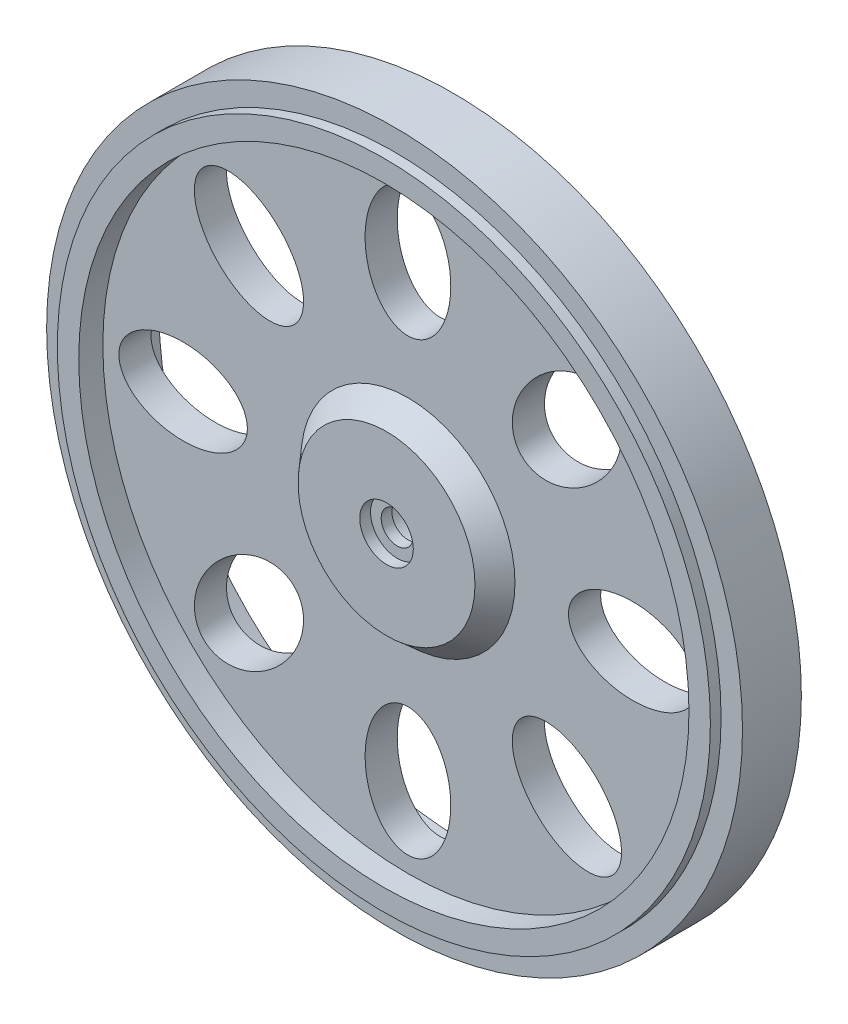
ISO-10303-21;
HEADER;
FILE_DESCRIPTION(('STEP AP214'),'2;1');
FILE_NAME('part.step','',(''),(''),'','','');
FILE_SCHEMA(('AUTOMOTIVE_DESIGN { 1 0 10303 214 1 1 1 1 }'));
ENDSEC;
DATA;
#1=APPLICATION_CONTEXT('core data for automotive mechanical design processes');
#2=APPLICATION_PROTOCOL_DEFINITION('international standard','automotive_design',2000,#1);
#3=PRODUCT_CONTEXT('',#1,'mechanical');
#4=PRODUCT('Part','Part','',(#3));
#5=PRODUCT_RELATED_PRODUCT_CATEGORY('part','',(#4));
#6=PRODUCT_DEFINITION_FORMATION('','',#4);
#7=PRODUCT_DEFINITION_CONTEXT('part definition',#1,'design');
#8=PRODUCT_DEFINITION('design','',#6,#7);
#9=PRODUCT_DEFINITION_SHAPE('','',#8);
#10=(LENGTH_UNIT() NAMED_UNIT(*) SI_UNIT(.MILLI.,.METRE.));
#11=(NAMED_UNIT(*) PLANE_ANGLE_UNIT() SI_UNIT($,.RADIAN.));
#12=(NAMED_UNIT(*) SI_UNIT($,.STERADIAN.) SOLID_ANGLE_UNIT());
#13=UNCERTAINTY_MEASURE_WITH_UNIT(LENGTH_MEASURE(1.E-05),#10,'distance_accuracy_value','');
#14=(GEOMETRIC_REPRESENTATION_CONTEXT(3) GLOBAL_UNCERTAINTY_ASSIGNED_CONTEXT((#13)) GLOBAL_UNIT_ASSIGNED_CONTEXT((#10,
#11,#12)) REPRESENTATION_CONTEXT('',''));
#15=CARTESIAN_POINT('',(0.,0.,0.));
#16=DIRECTION('',(0.,0.,1.));
#17=DIRECTION('',(1.,0.,0.));
#18=AXIS2_PLACEMENT_3D('',#15,#16,#17);
#19=CARTESIAN_POINT('',(0.,0.,26.5));
#20=DIRECTION('',(0.,0.,-1.));
#21=DIRECTION('',(-1.,0.,0.));
#22=AXIS2_PLACEMENT_3D('',#19,#20,#21);
#23=CYLINDRICAL_SURFACE('',#22,1.5);
#24=CARTESIAN_POINT('',(0.,0.,2.5));
#25=DIRECTION('',(0.,0.,1.));
#26=DIRECTION('',(1.,0.,0.));
#27=AXIS2_PLACEMENT_3D('',#24,#25,#26);
#28=CIRCLE('',#27,1.5);
#29=CARTESIAN_POINT('',(1.5,0.,2.5));
#30=VERTEX_POINT('',#29);
#31=EDGE_CURVE('E50',#30,#30,#28,.F.);
#32=ORIENTED_EDGE('',*,*,#31,.F.);
#33=EDGE_LOOP('',(#32));
#34=FACE_BOUND('',#33,.T.);
#35=CARTESIAN_POINT('',(0.,0.,1.5));
#36=DIRECTION('',(0.,0.,-1.));
#37=DIRECTION('',(-1.,0.,0.));
#38=AXIS2_PLACEMENT_3D('',#35,#36,#37);
#39=CIRCLE('',#38,1.5);
#40=CARTESIAN_POINT('',(-1.5,0.,1.5));
#41=VERTEX_POINT('',#40);
#42=EDGE_CURVE('E38',#41,#41,#39,.T.);
#43=ORIENTED_EDGE('',*,*,#42,.T.);
#44=EDGE_LOOP('',(#43));
#45=FACE_BOUND('',#44,.T.);
#46=ADVANCED_FACE('F34',(#34,#45),#23,.F.);
#47=CARTESIAN_POINT('',(0.,0.,-5.5));
#48=DIRECTION('',(0.,0.,-1.));
#49=DIRECTION('',(-1.,0.,0.));
#50=AXIS2_PLACEMENT_3D('',#47,#48,#49);
#51=PLANE('',#50);
#52=CARTESIAN_POINT('',(0.,0.,-5.5));
#53=DIRECTION('',(0.,0.,-1.));
#54=DIRECTION('',(-1.,0.,0.));
#55=AXIS2_PLACEMENT_3D('',#52,#53,#54);
#56=CIRCLE('',#55,2.75);
#57=CARTESIAN_POINT('',(-2.75,0.,-5.5));
#58=VERTEX_POINT('',#57);
#59=EDGE_CURVE('E412',#58,#58,#56,.T.);
#60=ORIENTED_EDGE('',*,*,#59,.F.);
#61=EDGE_LOOP('',(#60));
#62=FACE_BOUND('',#61,.T.);
#63=CARTESIAN_POINT('',(0.,0.,-5.5));
#64=DIRECTION('',(0.,0.,-1.));
#65=DIRECTION('',(-1.,0.,0.));
#66=AXIS2_PLACEMENT_3D('',#63,#64,#65);
#67=CIRCLE('',#66,4.42820323027551);
#68=CARTESIAN_POINT('',(-4.42820323027551,0.,-5.5));
#69=VERTEX_POINT('',#68);
#70=EDGE_CURVE('E70',#69,#69,#67,.T.);
#71=ORIENTED_EDGE('',*,*,#70,.T.);
#72=EDGE_LOOP('',(#71));
#73=FACE_BOUND('',#72,.T.);
#74=ADVANCED_FACE('F138',(#62,#73),#51,.T.);
#75=CARTESIAN_POINT('',(0.,0.,2.5));
#76=DIRECTION('',(0.,0.,1.));
#77=DIRECTION('',(1.,0.,0.));
#78=AXIS2_PLACEMENT_3D('',#75,#76,#77);
#79=PLANE('',#78);
#80=CARTESIAN_POINT('',(0.,0.,2.5));
#81=DIRECTION('',(0.,0.,1.));
#82=DIRECTION('',(1.,0.,0.));
#83=AXIS2_PLACEMENT_3D('',#80,#81,#82);
#84=CIRCLE('',#83,2.5);
#85=CARTESIAN_POINT('',(2.5,0.,2.5));
#86=VERTEX_POINT('',#85);
#87=EDGE_CURVE('E57',#86,#86,#84,.T.);
#88=ORIENTED_EDGE('',*,*,#87,.T.);
#89=EDGE_LOOP('',(#88));
#90=FACE_BOUND('',#89,.T.);
#91=ORIENTED_EDGE('',*,*,#31,.T.);
#92=EDGE_LOOP('',(#91));
#93=FACE_BOUND('',#92,.T.);
#94=ADVANCED_FACE('F129',(#90,#93),#79,.T.);
#95=CARTESIAN_POINT('',(0.,28.5,-1.5));
#96=DIRECTION('',(0.,0.,1.));
#97=DIRECTION('',(1.,0.,0.));
#98=AXIS2_PLACEMENT_3D('',#95,#96,#97);
#99=PLANE('',#98);
#100=CARTESIAN_POINT('',(14.8492424049173,14.8492424049177,-1.5));
#101=DIRECTION('',(0.,0.,1.));
#102=DIRECTION('',(-0.707106781186539,-0.707106781186556,0.));
#103=AXIS2_PLACEMENT_3D('',#100,#101,#102);
#104=ELLIPSE('',#103,6.,4.);
#105=CARTESIAN_POINT('',(10.6066017177981,10.6066017177983,-1.5));
#106=VERTEX_POINT('',#105);
#107=EDGE_CURVE('E417',#106,#106,#104,.T.);
#108=ORIENTED_EDGE('',*,*,#107,.T.);
#109=EDGE_LOOP('',(#108));
#110=FACE_BOUND('',#109,.T.);
#111=CARTESIAN_POINT('',(21.,2.19963451749891E-13,-1.5));
#112=DIRECTION('',(0.,0.,1.));
#113=DIRECTION('',(-1.,0.,0.));
#114=AXIS2_PLACEMENT_3D('',#111,#112,#113);
#115=ELLIPSE('',#114,6.,4.);
#116=CARTESIAN_POINT('',(15.,1.57116751249922E-13,-1.5));
#117=VERTEX_POINT('',#116);
#118=EDGE_CURVE('E423',#117,#117,#115,.T.);
#119=ORIENTED_EDGE('',*,*,#118,.T.);
#120=EDGE_LOOP('',(#119));
#121=FACE_BOUND('',#120,.T.);
#122=CARTESIAN_POINT('',(14.8492424049176,-14.8492424049174,-1.5));
#123=DIRECTION('',(0.,0.,1.));
#124=DIRECTION('',(-0.707106781186554,0.707106781186541,0.));
#125=AXIS2_PLACEMENT_3D('',#122,#123,#124);
#126=ELLIPSE('',#125,6.,4.);
#127=CARTESIAN_POINT('',(10.6066017177983,-10.6066017177981,-1.5));
#128=VERTEX_POINT('',#127);
#129=EDGE_CURVE('E434',#128,#128,#126,.T.);
#130=ORIENTED_EDGE('',*,*,#129,.T.);
#131=EDGE_LOOP('',(#130));
#132=FACE_BOUND('',#131,.T.);
#133=CARTESIAN_POINT('',(1.46642301166594E-13,-21.,-1.5));
#134=DIRECTION('',(0.,0.,1.));
#135=DIRECTION('',(0.,1.,0.));
#136=AXIS2_PLACEMENT_3D('',#133,#134,#135);
#137=ELLIPSE('',#136,6.,4.);
#138=CARTESIAN_POINT('',(1.04744500833281E-13,-15.,-1.5));
#139=VERTEX_POINT('',#138);
#140=EDGE_CURVE('E438',#139,#139,#137,.T.);
#141=ORIENTED_EDGE('',*,*,#140,.T.);
#142=EDGE_LOOP('',(#141));
#143=FACE_BOUND('',#142,.T.);
#144=CARTESIAN_POINT('',(-14.8492424049174,-14.8492424049176,-1.5));
#145=DIRECTION('',(0.,0.,1.));
#146=DIRECTION('',(0.707106781186544,0.707106781186551,0.));
#147=AXIS2_PLACEMENT_3D('',#144,#145,#146);
#148=ELLIPSE('',#147,6.,4.);
#149=CARTESIAN_POINT('',(-10.6066017177982,-10.6066017177983,-1.5));
#150=VERTEX_POINT('',#149);
#151=EDGE_CURVE('E445',#150,#150,#148,.T.);
#152=ORIENTED_EDGE('',*,*,#151,.T.);
#153=EDGE_LOOP('',(#152));
#154=FACE_BOUND('',#153,.T.);
#155=CARTESIAN_POINT('',(-21.,0.,-1.5));
#156=DIRECTION('',(0.,0.,1.));
#157=DIRECTION('',(1.,0.,0.));
#158=AXIS2_PLACEMENT_3D('',#155,#156,#157);
#159=ELLIPSE('',#158,6.,4.);
#160=CARTESIAN_POINT('',(-15.,0.,-1.5));
#161=VERTEX_POINT('',#160);
#162=EDGE_CURVE('E455',#161,#161,#159,.T.);
#163=ORIENTED_EDGE('',*,*,#162,.T.);
#164=EDGE_LOOP('',(#163));
#165=FACE_BOUND('',#164,.T.);
#166=CARTESIAN_POINT('',(-14.8492424049175,14.8492424049175,-1.5));
#167=DIRECTION('',(0.,0.,1.));
#168=DIRECTION('',(0.707106781186549,-0.707106781186546,0.));
#169=AXIS2_PLACEMENT_3D('',#166,#167,#168);
#170=ELLIPSE('',#169,6.,4.);
#171=CARTESIAN_POINT('',(-10.6066017177982,10.6066017177982,-1.5));
#172=VERTEX_POINT('',#171);
#173=EDGE_CURVE('E65',#172,#172,#170,.T.);
#174=ORIENTED_EDGE('',*,*,#173,.T.);
#175=EDGE_LOOP('',(#174));
#176=FACE_BOUND('',#175,.T.);
#177=CARTESIAN_POINT('',(0.,21.,-1.5));
#178=DIRECTION('',(0.,0.,1.));
#179=DIRECTION('',(0.,-1.,0.));
#180=AXIS2_PLACEMENT_3D('',#177,#178,#179);
#181=ELLIPSE('',#180,6.,4.);
#182=CARTESIAN_POINT('',(0.,15.,-1.5));
#183=VERTEX_POINT('',#182);
#184=EDGE_CURVE('E53',#183,#183,#181,.T.);
#185=ORIENTED_EDGE('',*,*,#184,.T.);
#186=EDGE_LOOP('',(#185));
#187=FACE_BOUND('',#186,.T.);
#188=CARTESIAN_POINT('',(0.,0.,-1.5));
#189=DIRECTION('',(0.,0.,1.));
#190=DIRECTION('',(1.,0.,0.));
#191=AXIS2_PLACEMENT_3D('',#188,#189,#190);
#192=CIRCLE('',#191,28.5);
#193=CARTESIAN_POINT('',(28.5,0.,-1.5));
#194=VERTEX_POINT('',#193);
#195=EDGE_CURVE('E95',#194,#194,#192,.T.);
#196=ORIENTED_EDGE('',*,*,#195,.F.);
#197=EDGE_LOOP('',(#196));
#198=FACE_BOUND('',#197,.T.);
#199=CARTESIAN_POINT('',(0.,0.,-1.5));
#200=DIRECTION('',(0.,0.,1.));
#201=DIRECTION('',(1.,0.,0.));
#202=AXIS2_PLACEMENT_3D('',#199,#200,#201);
#203=CIRCLE('',#202,5.5);
#204=CARTESIAN_POINT('',(5.5,0.,-1.5));
#205=VERTEX_POINT('',#204);
#206=EDGE_CURVE('E10',#205,#205,#203,.F.);
#207=ORIENTED_EDGE('',*,*,#206,.F.);
#208=EDGE_LOOP('',(#207));
#209=FACE_BOUND('',#208,.T.);
#210=ADVANCED_FACE('F125',(#110,#121,#132,#143,#154,#165,#176,#187,#198,#209),#99,.F.);
#211=CARTESIAN_POINT('',(0.,28.5,1.5));
#212=DIRECTION('',(0.,0.,-1.));
#213=DIRECTION('',(-1.,0.,0.));
#214=AXIS2_PLACEMENT_3D('',#211,#212,#213);
#215=PLANE('',#214);
#216=CARTESIAN_POINT('',(14.8492424049173,14.8492424049177,1.5));
#217=DIRECTION('',(0.,0.,1.));
#218=DIRECTION('',(-0.707106781186539,-0.707106781186556,0.));
#219=AXIS2_PLACEMENT_3D('',#216,#217,#218);
#220=ELLIPSE('',#219,6.,4.);
#221=CARTESIAN_POINT('',(10.6066017177981,10.6066017177983,1.5));
#222=VERTEX_POINT('',#221);
#223=EDGE_CURVE('E414',#222,#222,#220,.T.);
#224=ORIENTED_EDGE('',*,*,#223,.F.);
#225=EDGE_LOOP('',(#224));
#226=FACE_BOUND('',#225,.T.);
#227=CARTESIAN_POINT('',(21.,2.19963451749891E-13,1.5));
#228=DIRECTION('',(0.,0.,1.));
#229=DIRECTION('',(-1.,0.,0.));
#230=AXIS2_PLACEMENT_3D('',#227,#228,#229);
#231=ELLIPSE('',#230,6.,4.);
#232=CARTESIAN_POINT('',(15.,1.57116751249922E-13,1.5));
#233=VERTEX_POINT('',#232);
#234=EDGE_CURVE('E418',#233,#233,#231,.T.);
#235=ORIENTED_EDGE('',*,*,#234,.F.);
#236=EDGE_LOOP('',(#235));
#237=FACE_BOUND('',#236,.T.);
#238=CARTESIAN_POINT('',(14.8492424049176,-14.8492424049174,1.5));
#239=DIRECTION('',(0.,0.,1.));
#240=DIRECTION('',(-0.707106781186554,0.707106781186541,0.));
#241=AXIS2_PLACEMENT_3D('',#238,#239,#240);
#242=ELLIPSE('',#241,6.,4.);
#243=CARTESIAN_POINT('',(10.6066017177983,-10.6066017177981,1.5));
#244=VERTEX_POINT('',#243);
#245=EDGE_CURVE('E426',#244,#244,#242,.T.);
#246=ORIENTED_EDGE('',*,*,#245,.F.);
#247=EDGE_LOOP('',(#246));
#248=FACE_BOUND('',#247,.T.);
#249=CARTESIAN_POINT('',(1.46642301166594E-13,-21.,1.5));
#250=DIRECTION('',(0.,0.,1.));
#251=DIRECTION('',(0.,1.,0.));
#252=AXIS2_PLACEMENT_3D('',#249,#250,#251);
#253=ELLIPSE('',#252,6.,4.);
#254=CARTESIAN_POINT('',(1.04744500833281E-13,-15.,1.5));
#255=VERTEX_POINT('',#254);
#256=EDGE_CURVE('E435',#255,#255,#253,.T.);
#257=ORIENTED_EDGE('',*,*,#256,.F.);
#258=EDGE_LOOP('',(#257));
#259=FACE_BOUND('',#258,.T.);
#260=CARTESIAN_POINT('',(-14.8492424049174,-14.8492424049176,1.5));
#261=DIRECTION('',(0.,0.,1.));
#262=DIRECTION('',(0.707106781186544,0.707106781186551,0.));
#263=AXIS2_PLACEMENT_3D('',#260,#261,#262);
#264=ELLIPSE('',#263,6.,4.);
#265=CARTESIAN_POINT('',(-10.6066017177982,-10.6066017177983,1.5));
#266=VERTEX_POINT('',#265);
#267=EDGE_CURVE('E440',#266,#266,#264,.T.);
#268=ORIENTED_EDGE('',*,*,#267,.F.);
#269=EDGE_LOOP('',(#268));
#270=FACE_BOUND('',#269,.T.);
#271=CARTESIAN_POINT('',(-21.,0.,1.5));
#272=DIRECTION('',(0.,0.,1.));
#273=DIRECTION('',(1.,0.,0.));
#274=AXIS2_PLACEMENT_3D('',#271,#272,#273);
#275=ELLIPSE('',#274,6.,4.);
#276=CARTESIAN_POINT('',(-15.,0.,1.5));
#277=VERTEX_POINT('',#276);
#278=EDGE_CURVE('E448',#277,#277,#275,.T.);
#279=ORIENTED_EDGE('',*,*,#278,.F.);
#280=EDGE_LOOP('',(#279));
#281=FACE_BOUND('',#280,.T.);
#282=CARTESIAN_POINT('',(-14.8492424049175,14.8492424049175,1.5));
#283=DIRECTION('',(0.,0.,1.));
#284=DIRECTION('',(0.707106781186549,-0.707106781186546,0.));
#285=AXIS2_PLACEMENT_3D('',#282,#283,#284);
#286=ELLIPSE('',#285,6.,4.);
#287=CARTESIAN_POINT('',(-10.6066017177982,10.6066017177982,1.5));
#288=VERTEX_POINT('',#287);
#289=EDGE_CURVE('E456',#288,#288,#286,.T.);
#290=ORIENTED_EDGE('',*,*,#289,.F.);
#291=EDGE_LOOP('',(#290));
#292=FACE_BOUND('',#291,.T.);
#293=CARTESIAN_POINT('',(0.,21.,1.5));
#294=DIRECTION('',(0.,0.,1.));
#295=DIRECTION('',(0.,-1.,0.));
#296=AXIS2_PLACEMENT_3D('',#293,#294,#295);
#297=ELLIPSE('',#296,6.,4.);
#298=CARTESIAN_POINT('',(0.,15.,1.5));
#299=VERTEX_POINT('',#298);
#300=EDGE_CURVE('E60',#299,#299,#297,.T.);
#301=ORIENTED_EDGE('',*,*,#300,.F.);
#302=EDGE_LOOP('',(#301));
#303=FACE_BOUND('',#302,.T.);
#304=CARTESIAN_POINT('',(0.,0.,1.5));
#305=DIRECTION('',(0.,0.,1.));
#306=DIRECTION('',(1.,0.,0.));
#307=AXIS2_PLACEMENT_3D('',#304,#305,#306);
#308=CIRCLE('',#307,28.5);
#309=CARTESIAN_POINT('',(28.5,0.,1.5));
#310=VERTEX_POINT('',#309);
#311=EDGE_CURVE('E92',#310,#310,#308,.T.);
#312=ORIENTED_EDGE('',*,*,#311,.T.);
#313=EDGE_LOOP('',(#312));
#314=FACE_BOUND('',#313,.T.);
#315=CARTESIAN_POINT('',(0.,0.,1.5));
#316=DIRECTION('',(0.,0.,-1.));
#317=DIRECTION('',(-1.,0.,0.));
#318=AXIS2_PLACEMENT_3D('',#315,#316,#317);
#319=CIRCLE('',#318,10.);
#320=CARTESIAN_POINT('',(-10.,0.,1.5));
#321=VERTEX_POINT('',#320);
#322=EDGE_CURVE('E42',#321,#321,#319,.F.);
#323=ORIENTED_EDGE('',*,*,#322,.F.);
#324=EDGE_LOOP('',(#323));
#325=FACE_BOUND('',#324,.T.);
#326=ADVANCED_FACE('F128',(#226,#237,#248,#259,#270,#281,#292,#303,#314,#325),#215,.F.);
#327=CARTESIAN_POINT('',(0.,30.5,-2.75));
#328=DIRECTION('',(0.,0.,1.));
#329=DIRECTION('',(1.,0.,0.));
#330=AXIS2_PLACEMENT_3D('',#327,#328,#329);
#331=PLANE('',#330);
#332=CARTESIAN_POINT('',(0.,0.,-2.75));
#333=DIRECTION('',(0.,0.,1.));
#334=DIRECTION('',(1.,0.,0.));
#335=AXIS2_PLACEMENT_3D('',#332,#333,#334);
#336=CIRCLE('',#335,32.5);
#337=CARTESIAN_POINT('',(32.5,0.,-2.75));
#338=VERTEX_POINT('',#337);
#339=EDGE_CURVE('E77',#338,#338,#336,.T.);
#340=ORIENTED_EDGE('',*,*,#339,.F.);
#341=EDGE_LOOP('',(#340));
#342=FACE_BOUND('',#341,.T.);
#343=CARTESIAN_POINT('',(0.,0.,-2.75));
#344=DIRECTION('',(0.,0.,1.));
#345=DIRECTION('',(1.,0.,0.));
#346=AXIS2_PLACEMENT_3D('',#343,#344,#345);
#347=CIRCLE('',#346,30.5);
#348=CARTESIAN_POINT('',(30.5,0.,-2.75));
#349=VERTEX_POINT('',#348);
#350=EDGE_CURVE('E47',#349,#349,#347,.T.);
#351=ORIENTED_EDGE('',*,*,#350,.T.);
#352=EDGE_LOOP('',(#351));
#353=FACE_BOUND('',#352,.T.);
#354=ADVANCED_FACE('F36',(#342,#353),#331,.F.);
#355=CARTESIAN_POINT('',(0.,0.,21.1884062869707));
#356=DIRECTION('',(0.,0.,1.));
#357=DIRECTION('',(1.,0.,0.));
#358=AXIS2_PLACEMENT_3D('',#355,#356,#357);
#359=CYLINDRICAL_SURFACE('',#358,30.5);
#360=ORIENTED_EDGE('',*,*,#350,.F.);
#361=EDGE_LOOP('',(#360));
#362=FACE_BOUND('',#361,.T.);
#363=CARTESIAN_POINT('',(0.,0.,-3.75));
#364=DIRECTION('',(0.,0.,1.));
#365=DIRECTION('',(1.,0.,0.));
#366=AXIS2_PLACEMENT_3D('',#363,#364,#365);
#367=CIRCLE('',#366,30.5);
#368=CARTESIAN_POINT('',(30.5,0.,-3.75));
#369=VERTEX_POINT('',#368);
#370=EDGE_CURVE('E101',#369,#369,#367,.T.);
#371=ORIENTED_EDGE('',*,*,#370,.T.);
#372=EDGE_LOOP('',(#371));
#373=FACE_BOUND('',#372,.T.);
#374=ADVANCED_FACE('F107',(#362,#373),#359,.T.);
#375=CARTESIAN_POINT('',(0.,28.5,-3.75));
#376=DIRECTION('',(0.,0.,1.));
#377=DIRECTION('',(1.,0.,0.));
#378=AXIS2_PLACEMENT_3D('',#375,#376,#377);
#379=PLANE('',#378);
#380=ORIENTED_EDGE('',*,*,#370,.F.);
#381=EDGE_LOOP('',(#380));
#382=FACE_BOUND('',#381,.T.);
#383=CARTESIAN_POINT('',(0.,0.,-3.75));
#384=DIRECTION('',(0.,0.,1.));
#385=DIRECTION('',(1.,0.,0.));
#386=AXIS2_PLACEMENT_3D('',#383,#384,#385);
#387=CIRCLE('',#386,28.5);
#388=CARTESIAN_POINT('',(28.5,0.,-3.75));
#389=VERTEX_POINT('',#388);
#390=EDGE_CURVE('E98',#389,#389,#387,.T.);
#391=ORIENTED_EDGE('',*,*,#390,.T.);
#392=EDGE_LOOP('',(#391));
#393=FACE_BOUND('',#392,.T.);
#394=ADVANCED_FACE('F110',(#382,#393),#379,.F.);
#395=CARTESIAN_POINT('',(0.,0.,21.1884062869707));
#396=DIRECTION('',(0.,0.,1.));
#397=DIRECTION('',(1.,0.,0.));
#398=AXIS2_PLACEMENT_3D('',#395,#396,#397);
#399=CYLINDRICAL_SURFACE('',#398,28.5);
#400=ORIENTED_EDGE('',*,*,#390,.F.);
#401=EDGE_LOOP('',(#400));
#402=FACE_BOUND('',#401,.T.);
#403=ORIENTED_EDGE('',*,*,#195,.T.);
#404=EDGE_LOOP('',(#403));
#405=FACE_BOUND('',#404,.T.);
#406=ADVANCED_FACE('F115',(#402,#405),#399,.F.);
#407=CARTESIAN_POINT('',(0.,0.,21.1884062869707));
#408=DIRECTION('',(0.,0.,1.));
#409=DIRECTION('',(1.,0.,0.));
#410=AXIS2_PLACEMENT_3D('',#407,#408,#409);
#411=CYLINDRICAL_SURFACE('',#410,28.5);
#412=ORIENTED_EDGE('',*,*,#311,.F.);
#413=EDGE_LOOP('',(#412));
#414=FACE_BOUND('',#413,.T.);
#415=CARTESIAN_POINT('',(0.,0.,3.75));
#416=DIRECTION('',(0.,0.,1.));
#417=DIRECTION('',(1.,0.,0.));
#418=AXIS2_PLACEMENT_3D('',#415,#416,#417);
#419=CIRCLE('',#418,28.5);
#420=CARTESIAN_POINT('',(28.5,0.,3.75));
#421=VERTEX_POINT('',#420);
#422=EDGE_CURVE('E89',#421,#421,#419,.T.);
#423=ORIENTED_EDGE('',*,*,#422,.T.);
#424=EDGE_LOOP('',(#423));
#425=FACE_BOUND('',#424,.T.);
#426=ADVANCED_FACE('F121',(#414,#425),#411,.F.);
#427=CARTESIAN_POINT('',(0.,28.5,3.75));
#428=DIRECTION('',(0.,0.,-1.));
#429=DIRECTION('',(-1.,0.,0.));
#430=AXIS2_PLACEMENT_3D('',#427,#428,#429);
#431=PLANE('',#430);
#432=ORIENTED_EDGE('',*,*,#422,.F.);
#433=EDGE_LOOP('',(#432));
#434=FACE_BOUND('',#433,.T.);
#435=CARTESIAN_POINT('',(0.,0.,3.75));
#436=DIRECTION('',(0.,0.,1.));
#437=DIRECTION('',(1.,0.,0.));
#438=AXIS2_PLACEMENT_3D('',#435,#436,#437);
#439=CIRCLE('',#438,30.5);
#440=CARTESIAN_POINT('',(30.5,0.,3.75));
#441=VERTEX_POINT('',#440);
#442=EDGE_CURVE('E86',#441,#441,#439,.T.);
#443=ORIENTED_EDGE('',*,*,#442,.T.);
#444=EDGE_LOOP('',(#443));
#445=FACE_BOUND('',#444,.T.);
#446=ADVANCED_FACE('F183',(#434,#445),#431,.F.);
#447=CARTESIAN_POINT('',(0.,0.,21.1884062869707));
#448=DIRECTION('',(0.,0.,1.));
#449=DIRECTION('',(1.,0.,0.));
#450=AXIS2_PLACEMENT_3D('',#447,#448,#449);
#451=CYLINDRICAL_SURFACE('',#450,30.5);
#452=ORIENTED_EDGE('',*,*,#442,.F.);
#453=EDGE_LOOP('',(#452));
#454=FACE_BOUND('',#453,.T.);
#455=CARTESIAN_POINT('',(0.,0.,2.75));
#456=DIRECTION('',(0.,0.,1.));
#457=DIRECTION('',(1.,0.,0.));
#458=AXIS2_PLACEMENT_3D('',#455,#456,#457);
#459=CIRCLE('',#458,30.5);
#460=CARTESIAN_POINT('',(30.5,0.,2.75));
#461=VERTEX_POINT('',#460);
#462=EDGE_CURVE('E83',#461,#461,#459,.T.);
#463=ORIENTED_EDGE('',*,*,#462,.T.);
#464=EDGE_LOOP('',(#463));
#465=FACE_BOUND('',#464,.T.);
#466=ADVANCED_FACE('F179',(#454,#465),#451,.T.);
#467=CARTESIAN_POINT('',(0.,30.5,2.75));
#468=DIRECTION('',(0.,0.,-1.));
#469=DIRECTION('',(-1.,0.,0.));
#470=AXIS2_PLACEMENT_3D('',#467,#468,#469);
#471=PLANE('',#470);
#472=ORIENTED_EDGE('',*,*,#462,.F.);
#473=EDGE_LOOP('',(#472));
#474=FACE_BOUND('',#473,.T.);
#475=CARTESIAN_POINT('',(0.,0.,2.75));
#476=DIRECTION('',(0.,0.,1.));
#477=DIRECTION('',(1.,0.,0.));
#478=AXIS2_PLACEMENT_3D('',#475,#476,#477);
#479=CIRCLE('',#478,32.5);
#480=CARTESIAN_POINT('',(32.5,0.,2.75));
#481=VERTEX_POINT('',#480);
#482=EDGE_CURVE('E80',#481,#481,#479,.T.);
#483=ORIENTED_EDGE('',*,*,#482,.T.);
#484=EDGE_LOOP('',(#483));
#485=FACE_BOUND('',#484,.T.);
#486=ADVANCED_FACE('F175',(#474,#485),#471,.F.);
#487=CARTESIAN_POINT('',(0.,0.,21.1884062869707));
#488=DIRECTION('',(0.,0.,1.));
#489=DIRECTION('',(1.,0.,0.));
#490=AXIS2_PLACEMENT_3D('',#487,#488,#489);
#491=CYLINDRICAL_SURFACE('',#490,32.5);
#492=ORIENTED_EDGE('',*,*,#482,.F.);
#493=EDGE_LOOP('',(#492));
#494=FACE_BOUND('',#493,.T.);
#495=ORIENTED_EDGE('',*,*,#339,.T.);
#496=EDGE_LOOP('',(#495));
#497=FACE_BOUND('',#496,.T.);
#498=ADVANCED_FACE('F171',(#494,#497),#491,.T.);
#499=CARTESIAN_POINT('',(0.,0.,1.5));
#500=DIRECTION('',(0.,0.,-1.));
#501=DIRECTION('',(1.,0.,0.));
#502=AXIS2_PLACEMENT_3D('',#499,#500,#501);
#503=CONICAL_SURFACE('',#502,10.,0.715584993317676);
#504=CARTESIAN_POINT('',(0.,0.,3.5));
#505=DIRECTION('',(0.,0.,1.));
#506=DIRECTION('',(1.,0.,0.));
#507=AXIS2_PLACEMENT_3D('',#504,#505,#506);
#508=CIRCLE('',#507,8.26142652436755);
#509=CARTESIAN_POINT('',(8.26142652436755,0.,3.5));
#510=VERTEX_POINT('',#509);
#511=EDGE_CURVE('E74',#510,#510,#508,.T.);
#512=ORIENTED_EDGE('',*,*,#511,.F.);
#513=EDGE_LOOP('',(#512));
#514=FACE_BOUND('',#513,.T.);
#515=ORIENTED_EDGE('',*,*,#322,.T.);
#516=EDGE_LOOP('',(#515));
#517=FACE_BOUND('',#516,.T.);
#518=ADVANCED_FACE('F167',(#514,#517),#503,.T.);
#519=CARTESIAN_POINT('',(0.,0.,3.5));
#520=DIRECTION('',(0.,0.,1.));
#521=DIRECTION('',(1.,0.,0.));
#522=AXIS2_PLACEMENT_3D('',#519,#520,#521);
#523=PLANE('',#522);
#524=CARTESIAN_POINT('',(0.,0.,3.5));
#525=DIRECTION('',(0.,0.,1.));
#526=DIRECTION('',(1.,0.,0.));
#527=AXIS2_PLACEMENT_3D('',#524,#525,#526);
#528=CIRCLE('',#527,2.5);
#529=CARTESIAN_POINT('',(2.5,0.,3.5));
#530=VERTEX_POINT('',#529);
#531=EDGE_CURVE('E52',#530,#530,#528,.T.);
#532=ORIENTED_EDGE('',*,*,#531,.F.);
#533=EDGE_LOOP('',(#532));
#534=FACE_BOUND('',#533,.T.);
#535=ORIENTED_EDGE('',*,*,#511,.T.);
#536=EDGE_LOOP('',(#535));
#537=FACE_BOUND('',#536,.T.);
#538=ADVANCED_FACE('F163',(#534,#537),#523,.T.);
#539=CARTESIAN_POINT('',(0.,0.,-1.5));
#540=DIRECTION('',(0.,0.,1.));
#541=DIRECTION('',(-1.,0.,0.));
#542=AXIS2_PLACEMENT_3D('',#539,#540,#541);
#543=CONICAL_SURFACE('',#542,5.5,0.261799387799149);
#544=ORIENTED_EDGE('',*,*,#70,.F.);
#545=EDGE_LOOP('',(#544));
#546=FACE_BOUND('',#545,.T.);
#547=ORIENTED_EDGE('',*,*,#206,.T.);
#548=EDGE_LOOP('',(#547));
#549=FACE_BOUND('',#548,.T.);
#550=ADVANCED_FACE('F158',(#546,#549),#543,.T.);
#551=CARTESIAN_POINT('',(0.,0.,2.5));
#552=DIRECTION('',(0.,0.,1.));
#553=DIRECTION('',(1.,0.,0.));
#554=AXIS2_PLACEMENT_3D('',#551,#552,#553);
#555=CYLINDRICAL_SURFACE('',#554,2.5);
#556=ORIENTED_EDGE('',*,*,#87,.F.);
#557=EDGE_LOOP('',(#556));
#558=FACE_BOUND('',#557,.T.);
#559=ORIENTED_EDGE('',*,*,#531,.T.);
#560=EDGE_LOOP('',(#559));
#561=FACE_BOUND('',#560,.T.);
#562=ADVANCED_FACE('F156',(#558,#561),#555,.F.);
#563=CARTESIAN_POINT('',(0.,21.,-13.5));
#564=DIRECTION('',(0.,0.,1.));
#565=DIRECTION('',(0.,-1.,0.));
#566=AXIS2_PLACEMENT_3D('',#563,#564,#565);
#567=ELLIPSE('',#566,6.,4.);
#568=DIRECTION('',(0.,0.,1.));
#569=VECTOR('',#568,1.);
#570=SURFACE_OF_LINEAR_EXTRUSION('',#567,#569);
#571=ORIENTED_EDGE('',*,*,#300,.T.);
#572=EDGE_LOOP('',(#571));
#573=FACE_BOUND('',#572,.T.);
#574=ORIENTED_EDGE('',*,*,#184,.F.);
#575=EDGE_LOOP('',(#574));
#576=FACE_BOUND('',#575,.T.);
#577=ADVANCED_FACE('F153',(#573,#576),#570,.F.);
#578=CARTESIAN_POINT('',(-14.8492424049175,14.8492424049175,-13.5));
#579=DIRECTION('',(0.,0.,1.));
#580=DIRECTION('',(0.707106781186549,-0.707106781186546,0.));
#581=AXIS2_PLACEMENT_3D('',#578,#579,#580);
#582=ELLIPSE('',#581,6.,4.);
#583=DIRECTION('',(0.,0.,1.));
#584=VECTOR('',#583,1.);
#585=SURFACE_OF_LINEAR_EXTRUSION('',#582,#584);
#586=ORIENTED_EDGE('',*,*,#289,.T.);
#587=EDGE_LOOP('',(#586));
#588=FACE_BOUND('',#587,.T.);
#589=ORIENTED_EDGE('',*,*,#173,.F.);
#590=EDGE_LOOP('',(#589));
#591=FACE_BOUND('',#590,.T.);
#592=ADVANCED_FACE('F290',(#588,#591),#585,.F.);
#593=CARTESIAN_POINT('',(-21.,0.,-13.5));
#594=DIRECTION('',(0.,0.,1.));
#595=DIRECTION('',(1.,0.,0.));
#596=AXIS2_PLACEMENT_3D('',#593,#594,#595);
#597=ELLIPSE('',#596,6.,4.);
#598=DIRECTION('',(0.,0.,1.));
#599=VECTOR('',#598,1.);
#600=SURFACE_OF_LINEAR_EXTRUSION('',#597,#599);
#601=ORIENTED_EDGE('',*,*,#278,.T.);
#602=EDGE_LOOP('',(#601));
#603=FACE_BOUND('',#602,.T.);
#604=ORIENTED_EDGE('',*,*,#162,.F.);
#605=EDGE_LOOP('',(#604));
#606=FACE_BOUND('',#605,.T.);
#607=ADVANCED_FACE('F307',(#603,#606),#600,.F.);
#608=CARTESIAN_POINT('',(-14.8492424049174,-14.8492424049176,-13.5));
#609=DIRECTION('',(0.,0.,1.));
#610=DIRECTION('',(0.707106781186544,0.707106781186551,0.));
#611=AXIS2_PLACEMENT_3D('',#608,#609,#610);
#612=ELLIPSE('',#611,6.,4.);
#613=DIRECTION('',(0.,0.,1.));
#614=VECTOR('',#613,1.);
#615=SURFACE_OF_LINEAR_EXTRUSION('',#612,#614);
#616=ORIENTED_EDGE('',*,*,#267,.T.);
#617=EDGE_LOOP('',(#616));
#618=FACE_BOUND('',#617,.T.);
#619=ORIENTED_EDGE('',*,*,#151,.F.);
#620=EDGE_LOOP('',(#619));
#621=FACE_BOUND('',#620,.T.);
#622=ADVANCED_FACE('F317',(#618,#621),#615,.F.);
#623=CARTESIAN_POINT('',(1.46642301166594E-13,-21.,-13.5));
#624=DIRECTION('',(0.,0.,1.));
#625=DIRECTION('',(0.,1.,0.));
#626=AXIS2_PLACEMENT_3D('',#623,#624,#625);
#627=ELLIPSE('',#626,6.,4.);
#628=DIRECTION('',(0.,0.,1.));
#629=VECTOR('',#628,1.);
#630=SURFACE_OF_LINEAR_EXTRUSION('',#627,#629);
#631=ORIENTED_EDGE('',*,*,#256,.T.);
#632=EDGE_LOOP('',(#631));
#633=FACE_BOUND('',#632,.T.);
#634=ORIENTED_EDGE('',*,*,#140,.F.);
#635=EDGE_LOOP('',(#634));
#636=FACE_BOUND('',#635,.T.);
#637=ADVANCED_FACE('F328',(#633,#636),#630,.F.);
#638=CARTESIAN_POINT('',(14.8492424049176,-14.8492424049174,-13.5));
#639=DIRECTION('',(0.,0.,1.));
#640=DIRECTION('',(-0.707106781186554,0.707106781186541,0.));
#641=AXIS2_PLACEMENT_3D('',#638,#639,#640);
#642=ELLIPSE('',#641,6.,4.);
#643=DIRECTION('',(0.,0.,1.));
#644=VECTOR('',#643,1.);
#645=SURFACE_OF_LINEAR_EXTRUSION('',#642,#644);
#646=ORIENTED_EDGE('',*,*,#245,.T.);
#647=EDGE_LOOP('',(#646));
#648=FACE_BOUND('',#647,.T.);
#649=ORIENTED_EDGE('',*,*,#129,.F.);
#650=EDGE_LOOP('',(#649));
#651=FACE_BOUND('',#650,.T.);
#652=ADVANCED_FACE('F339',(#648,#651),#645,.F.);
#653=CARTESIAN_POINT('',(21.,2.19963451749891E-13,-13.5));
#654=DIRECTION('',(0.,0.,1.));
#655=DIRECTION('',(-1.,0.,0.));
#656=AXIS2_PLACEMENT_3D('',#653,#654,#655);
#657=ELLIPSE('',#656,6.,4.);
#658=DIRECTION('',(0.,0.,1.));
#659=VECTOR('',#658,1.);
#660=SURFACE_OF_LINEAR_EXTRUSION('',#657,#659);
#661=ORIENTED_EDGE('',*,*,#234,.T.);
#662=EDGE_LOOP('',(#661));
#663=FACE_BOUND('',#662,.T.);
#664=ORIENTED_EDGE('',*,*,#118,.F.);
#665=EDGE_LOOP('',(#664));
#666=FACE_BOUND('',#665,.T.);
#667=ADVANCED_FACE('F350',(#663,#666),#660,.F.);
#668=CARTESIAN_POINT('',(14.8492424049173,14.8492424049177,-13.5));
#669=DIRECTION('',(0.,0.,1.));
#670=DIRECTION('',(-0.707106781186539,-0.707106781186556,0.));
#671=AXIS2_PLACEMENT_3D('',#668,#669,#670);
#672=ELLIPSE('',#671,6.,4.);
#673=DIRECTION('',(0.,0.,1.));
#674=VECTOR('',#673,1.);
#675=SURFACE_OF_LINEAR_EXTRUSION('',#672,#674);
#676=ORIENTED_EDGE('',*,*,#223,.T.);
#677=EDGE_LOOP('',(#676));
#678=FACE_BOUND('',#677,.T.);
#679=ORIENTED_EDGE('',*,*,#107,.F.);
#680=EDGE_LOOP('',(#679));
#681=FACE_BOUND('',#680,.T.);
#682=ADVANCED_FACE('F361',(#678,#681),#675,.F.);
#683=CARTESIAN_POINT('',(0.,0.,1.5));
#684=DIRECTION('',(0.,0.,-1.));
#685=DIRECTION('',(-1.,0.,0.));
#686=AXIS2_PLACEMENT_3D('',#683,#684,#685);
#687=CYLINDRICAL_SURFACE('',#686,2.75);
#688=CARTESIAN_POINT('',(0.,0.,1.5));
#689=DIRECTION('',(0.,0.,-1.));
#690=DIRECTION('',(-1.,0.,0.));
#691=AXIS2_PLACEMENT_3D('',#688,#689,#690);
#692=CIRCLE('',#691,2.75);
#693=CARTESIAN_POINT('',(-2.75,0.,1.5));
#694=VERTEX_POINT('',#693);
#695=EDGE_CURVE('E505',#694,#694,#692,.T.);
#696=ORIENTED_EDGE('',*,*,#695,.F.);
#697=EDGE_LOOP('',(#696));
#698=FACE_BOUND('',#697,.T.);
#699=ORIENTED_EDGE('',*,*,#59,.T.);
#700=EDGE_LOOP('',(#699));
#701=FACE_BOUND('',#700,.T.);
#702=ADVANCED_FACE('F371',(#698,#701),#687,.F.);
#703=CARTESIAN_POINT('',(0.,0.,1.5));
#704=DIRECTION('',(0.,0.,-1.));
#705=DIRECTION('',(-1.,0.,0.));
#706=AXIS2_PLACEMENT_3D('',#703,#704,#705);
#707=PLANE('',#706);
#708=ORIENTED_EDGE('',*,*,#42,.F.);
#709=EDGE_LOOP('',(#708));
#710=FACE_BOUND('',#709,.T.);
#711=ORIENTED_EDGE('',*,*,#695,.T.);
#712=EDGE_LOOP('',(#711));
#713=FACE_BOUND('',#712,.T.);
#714=ADVANCED_FACE('F391',(#710,#713),#707,.T.);
#715=CLOSED_SHELL('',(#46,#74,#94,#210,#326,#354,#374,#394,#406,#426,#446,#466,#486,#498,#518,
#538,#550,#562,#577,#592,#607,#622,#637,#652,#667,#682,#702,#714));
#716=MANIFOLD_SOLID_BREP('B2',#715);
#717=ADVANCED_BREP_SHAPE_REPRESENTATION('',(#18,#716),#14);
#718=SHAPE_DEFINITION_REPRESENTATION(#9,#717);
ENDSEC;
END-ISO-10303-21;
